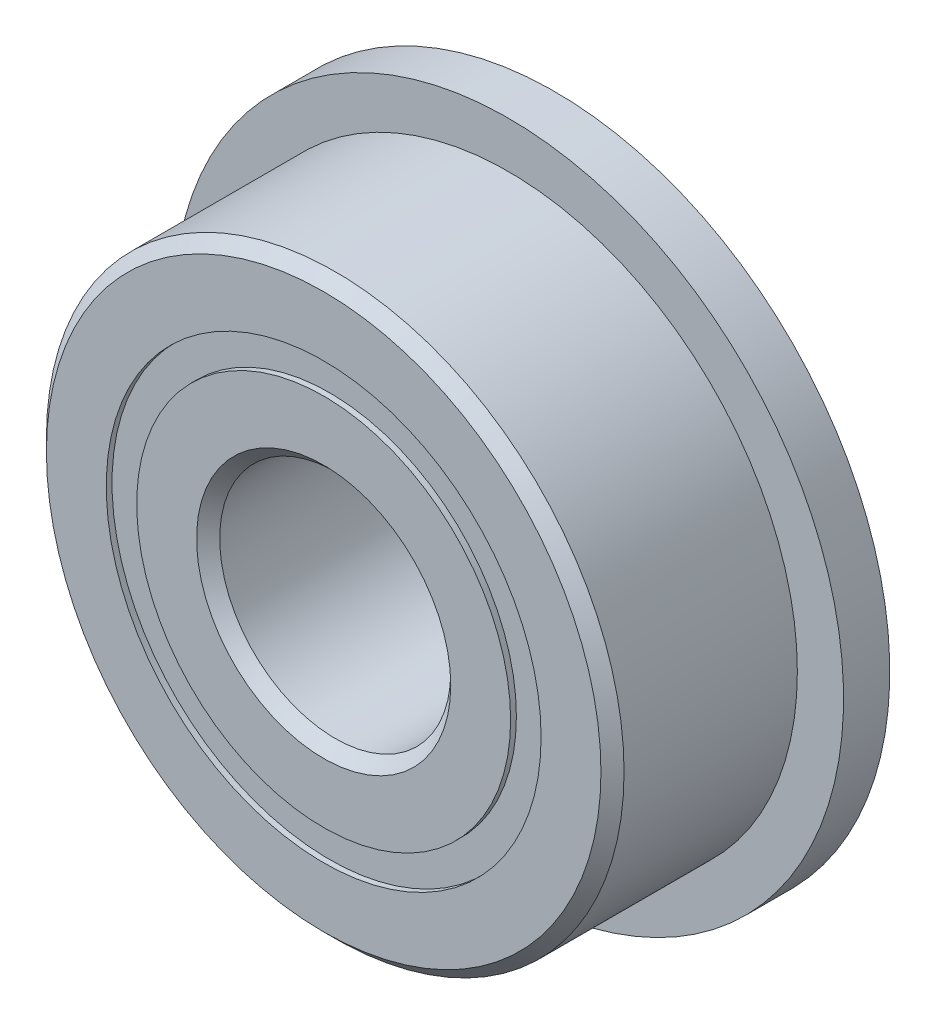
ISO-10303-21;
HEADER;
FILE_DESCRIPTION(('STEP AP214'),'2;1');
FILE_NAME('part.step','',(''),(''),'','','');
FILE_SCHEMA(('AUTOMOTIVE_DESIGN { 1 0 10303 214 1 1 1 1 }'));
ENDSEC;
DATA;
#1=APPLICATION_CONTEXT('core data for automotive mechanical design processes');
#2=APPLICATION_PROTOCOL_DEFINITION('international standard','automotive_design',2000,#1);
#3=PRODUCT_CONTEXT('',#1,'mechanical');
#4=PRODUCT('Part','Part','',(#3));
#5=PRODUCT_RELATED_PRODUCT_CATEGORY('part','',(#4));
#6=PRODUCT_DEFINITION_FORMATION('','',#4);
#7=PRODUCT_DEFINITION_CONTEXT('part definition',#1,'design');
#8=PRODUCT_DEFINITION('design','',#6,#7);
#9=PRODUCT_DEFINITION_SHAPE('','',#8);
#10=(LENGTH_UNIT() NAMED_UNIT(*) SI_UNIT(.MILLI.,.METRE.));
#11=(NAMED_UNIT(*) PLANE_ANGLE_UNIT() SI_UNIT($,.RADIAN.));
#12=(NAMED_UNIT(*) SI_UNIT($,.STERADIAN.) SOLID_ANGLE_UNIT());
#13=UNCERTAINTY_MEASURE_WITH_UNIT(LENGTH_MEASURE(1.E-05),#10,'distance_accuracy_value','');
#14=(GEOMETRIC_REPRESENTATION_CONTEXT(3) GLOBAL_UNCERTAINTY_ASSIGNED_CONTEXT((#13)) GLOBAL_UNIT_ASSIGNED_CONTEXT((#10,
#11,#12)) REPRESENTATION_CONTEXT('',''));
#15=CARTESIAN_POINT('',(0.,0.,0.));
#16=DIRECTION('',(0.,0.,1.));
#17=DIRECTION('',(1.,0.,0.));
#18=AXIS2_PLACEMENT_3D('',#15,#16,#17);
#19=CARTESIAN_POINT('',(0.,3.76373626373626,-1.9));
#20=DIRECTION('',(0.,0.,1.));
#21=DIRECTION('',(1.,0.,0.));
#22=AXIS2_PLACEMENT_3D('',#19,#20,#21);
#23=PLANE('',#22);
#24=CARTESIAN_POINT('',(0.,0.,-1.9));
#25=DIRECTION('',(0.,0.,1.));
#26=DIRECTION('',(1.,0.,0.));
#27=AXIS2_PLACEMENT_3D('',#24,#25,#26);
#28=CIRCLE('',#27,3.76373626373626);
#29=CARTESIAN_POINT('',(3.76373626373626,0.,-1.9));
#30=VERTEX_POINT('',#29);
#31=EDGE_CURVE('E56',#30,#30,#28,.T.);
#32=ORIENTED_EDGE('',*,*,#31,.F.);
#33=EDGE_LOOP('',(#32));
#34=FACE_BOUND('',#33,.T.);
#35=CARTESIAN_POINT('',(0.,0.,-1.9));
#36=DIRECTION('',(0.,0.,1.));
#37=DIRECTION('',(1.,0.,0.));
#38=AXIS2_PLACEMENT_3D('',#35,#36,#37);
#39=CIRCLE('',#38,3.23626373626373);
#40=CARTESIAN_POINT('',(3.23626373626373,0.,-1.9));
#41=VERTEX_POINT('',#40);
#42=EDGE_CURVE('E11',#41,#41,#39,.T.);
#43=ORIENTED_EDGE('',*,*,#42,.T.);
#44=EDGE_LOOP('',(#43));
#45=FACE_BOUND('',#44,.T.);
#46=ADVANCED_FACE('F42',(#34,#45),#23,.F.);
#47=CARTESIAN_POINT('',(0.,0.,2.));
#48=DIRECTION('',(0.,0.,1.));
#49=DIRECTION('',(1.,0.,0.));
#50=AXIS2_PLACEMENT_3D('',#47,#48,#49);
#51=CYLINDRICAL_SURFACE('',#50,3.23626373626374);
#52=ORIENTED_EDGE('',*,*,#42,.F.);
#53=EDGE_LOOP('',(#52));
#54=FACE_BOUND('',#53,.T.);
#55=CARTESIAN_POINT('',(0.,0.,-0.927189448602436));
#56=DIRECTION('',(0.,0.,1.));
#57=DIRECTION('',(1.,0.,0.));
#58=AXIS2_PLACEMENT_3D('',#55,#56,#57);
#59=CIRCLE('',#58,3.23626373626374);
#60=CARTESIAN_POINT('',(3.23626373626374,0.,-0.927189448602436));
#61=VERTEX_POINT('',#60);
#62=EDGE_CURVE('E48',#61,#61,#59,.T.);
#63=ORIENTED_EDGE('',*,*,#62,.T.);
#64=EDGE_LOOP('',(#63));
#65=FACE_BOUND('',#64,.T.);
#66=ADVANCED_FACE('F65',(#54,#65),#51,.F.);
#67=CARTESIAN_POINT('',(0.,3.76373626373626,-0.927189448602435));
#68=DIRECTION('',(0.,0.,-1.));
#69=DIRECTION('',(-1.,0.,0.));
#70=AXIS2_PLACEMENT_3D('',#67,#68,#69);
#71=PLANE('',#70);
#72=ORIENTED_EDGE('',*,*,#62,.F.);
#73=EDGE_LOOP('',(#72));
#74=FACE_BOUND('',#73,.T.);
#75=CARTESIAN_POINT('',(0.,0.,-0.927189448602436));
#76=DIRECTION('',(0.,0.,1.));
#77=DIRECTION('',(1.,0.,0.));
#78=AXIS2_PLACEMENT_3D('',#75,#76,#77);
#79=CIRCLE('',#78,3.76373626373626);
#80=CARTESIAN_POINT('',(3.76373626373626,0.,-0.927189448602436));
#81=VERTEX_POINT('',#80);
#82=EDGE_CURVE('E52',#81,#81,#79,.T.);
#83=ORIENTED_EDGE('',*,*,#82,.T.);
#84=EDGE_LOOP('',(#83));
#85=FACE_BOUND('',#84,.T.);
#86=ADVANCED_FACE('F69',(#74,#85),#71,.F.);
#87=CARTESIAN_POINT('',(0.,0.,2.));
#88=DIRECTION('',(0.,0.,1.));
#89=DIRECTION('',(1.,0.,0.));
#90=AXIS2_PLACEMENT_3D('',#87,#88,#89);
#91=CYLINDRICAL_SURFACE('',#90,3.76373626373626);
#92=ORIENTED_EDGE('',*,*,#82,.F.);
#93=EDGE_LOOP('',(#92));
#94=FACE_BOUND('',#93,.T.);
#95=ORIENTED_EDGE('',*,*,#31,.T.);
#96=EDGE_LOOP('',(#95));
#97=FACE_BOUND('',#96,.T.);
#98=ADVANCED_FACE('F62',(#94,#97),#91,.T.);
#99=CLOSED_SHELL('',(#46,#66,#86,#98));
#100=MANIFOLD_SOLID_BREP('B2',#99);
#101=CARTESIAN_POINT('',(0.,3.76373626373626,1.9));
#102=DIRECTION('',(0.,0.,-1.));
#103=DIRECTION('',(-1.,0.,0.));
#104=AXIS2_PLACEMENT_3D('',#101,#102,#103);
#105=PLANE('',#104);
#106=CARTESIAN_POINT('',(0.,0.,1.9));
#107=DIRECTION('',(0.,0.,1.));
#108=DIRECTION('',(1.,0.,0.));
#109=AXIS2_PLACEMENT_3D('',#106,#107,#108);
#110=CIRCLE('',#109,3.23626373626374);
#111=CARTESIAN_POINT('',(3.23626373626374,0.,1.9));
#112=VERTEX_POINT('',#111);
#113=EDGE_CURVE('E41',#112,#112,#110,.T.);
#114=ORIENTED_EDGE('',*,*,#113,.F.);
#115=EDGE_LOOP('',(#114));
#116=FACE_BOUND('',#115,.T.);
#117=CARTESIAN_POINT('',(0.,0.,1.9));
#118=DIRECTION('',(0.,0.,1.));
#119=DIRECTION('',(1.,0.,0.));
#120=AXIS2_PLACEMENT_3D('',#117,#118,#119);
#121=CIRCLE('',#120,3.76373626373626);
#122=CARTESIAN_POINT('',(3.76373626373626,0.,1.9));
#123=VERTEX_POINT('',#122);
#124=EDGE_CURVE('E124',#123,#123,#121,.T.);
#125=ORIENTED_EDGE('',*,*,#124,.T.);
#126=EDGE_LOOP('',(#125));
#127=FACE_BOUND('',#126,.T.);
#128=ADVANCED_FACE('F110',(#116,#127),#105,.F.);
#129=CARTESIAN_POINT('',(0.,0.,2.));
#130=DIRECTION('',(0.,0.,1.));
#131=DIRECTION('',(1.,0.,0.));
#132=AXIS2_PLACEMENT_3D('',#129,#130,#131);
#133=CYLINDRICAL_SURFACE('',#132,3.23626373626374);
#134=CARTESIAN_POINT('',(0.,0.,0.927189448602434));
#135=DIRECTION('',(0.,0.,1.));
#136=DIRECTION('',(1.,0.,0.));
#137=AXIS2_PLACEMENT_3D('',#134,#135,#136);
#138=CIRCLE('',#137,3.23626373626374);
#139=CARTESIAN_POINT('',(3.23626373626374,0.,0.927189448602434));
#140=VERTEX_POINT('',#139);
#141=EDGE_CURVE('E116',#140,#140,#138,.T.);
#142=ORIENTED_EDGE('',*,*,#141,.F.);
#143=EDGE_LOOP('',(#142));
#144=FACE_BOUND('',#143,.T.);
#145=ORIENTED_EDGE('',*,*,#113,.T.);
#146=EDGE_LOOP('',(#145));
#147=FACE_BOUND('',#146,.T.);
#148=ADVANCED_FACE('F139',(#144,#147),#133,.F.);
#149=CARTESIAN_POINT('',(0.,3.76373626373626,0.927189448602434));
#150=DIRECTION('',(0.,0.,1.));
#151=DIRECTION('',(1.,0.,0.));
#152=AXIS2_PLACEMENT_3D('',#149,#150,#151);
#153=PLANE('',#152);
#154=CARTESIAN_POINT('',(0.,0.,0.927189448602434));
#155=DIRECTION('',(0.,0.,1.));
#156=DIRECTION('',(1.,0.,0.));
#157=AXIS2_PLACEMENT_3D('',#154,#155,#156);
#158=CIRCLE('',#157,3.76373626373626);
#159=CARTESIAN_POINT('',(3.76373626373626,0.,0.927189448602434));
#160=VERTEX_POINT('',#159);
#161=EDGE_CURVE('E120',#160,#160,#158,.T.);
#162=ORIENTED_EDGE('',*,*,#161,.F.);
#163=EDGE_LOOP('',(#162));
#164=FACE_BOUND('',#163,.T.);
#165=ORIENTED_EDGE('',*,*,#141,.T.);
#166=EDGE_LOOP('',(#165));
#167=FACE_BOUND('',#166,.T.);
#168=ADVANCED_FACE('F134',(#164,#167),#153,.F.);
#169=CARTESIAN_POINT('',(0.,0.,2.));
#170=DIRECTION('',(0.,0.,1.));
#171=DIRECTION('',(1.,0.,0.));
#172=AXIS2_PLACEMENT_3D('',#169,#170,#171);
#173=CYLINDRICAL_SURFACE('',#172,3.76373626373626);
#174=ORIENTED_EDGE('',*,*,#124,.F.);
#175=EDGE_LOOP('',(#174));
#176=FACE_BOUND('',#175,.T.);
#177=ORIENTED_EDGE('',*,*,#161,.T.);
#178=EDGE_LOOP('',(#177));
#179=FACE_BOUND('',#178,.T.);
#180=ADVANCED_FACE('F131',(#176,#179),#173,.T.);
#181=CLOSED_SHELL('',(#128,#148,#168,#180));
#182=MANIFOLD_SOLID_BREP('B6',#181);
#183=CARTESIAN_POINT('',(-1.74999999999996,3.03108891324556,0.));
#184=DIRECTION('',(0.,0.,1.));
#185=DIRECTION('',(-0.499999999999989,0.866025403784445,0.));
#186=AXIS2_PLACEMENT_3D('',#183,#184,#185);
#187=SPHERICAL_SURFACE('',#186,0.927189448602435);
#188=CARTESIAN_POINT('',(-1.74999999999996,3.03108891324556,0.927189448602434));
#189=VERTEX_POINT('',#188);
#190=VERTEX_LOOP('',#189);
#191=FACE_BOUND('',#190,.T.);
#192=ADVANCED_FACE('F177',(#191),#187,.T.);
#193=CLOSED_SHELL('',(#192));
#194=MANIFOLD_SOLID_BREP('B36',#193);
#195=CARTESIAN_POINT('',(-3.03108891324552,1.75000000000004,0.));
#196=DIRECTION('',(0.,0.,1.));
#197=DIRECTION('',(-0.866025403784433,0.50000000000001,0.));
#198=AXIS2_PLACEMENT_3D('',#195,#196,#197);
#199=SPHERICAL_SURFACE('',#198,0.927189448602435);
#200=CARTESIAN_POINT('',(-3.03108891324552,1.75000000000004,0.927189448602434));
#201=VERTEX_POINT('',#200);
#202=VERTEX_LOOP('',#201);
#203=FACE_BOUND('',#202,.T.);
#204=ADVANCED_FACE('F197',(#203),#199,.T.);
#205=CLOSED_SHELL('',(#204));
#206=MANIFOLD_SOLID_BREP('B106',#205);
#207=CARTESIAN_POINT('',(-3.5,0.,0.));
#208=DIRECTION('',(0.,0.,1.));
#209=DIRECTION('',(-1.,0.,0.));
#210=AXIS2_PLACEMENT_3D('',#207,#208,#209);
#211=SPHERICAL_SURFACE('',#210,0.927189448602435);
#212=CARTESIAN_POINT('',(-3.5,0.,0.927189448602434));
#213=VERTEX_POINT('',#212);
#214=VERTEX_LOOP('',#213);
#215=FACE_BOUND('',#214,.T.);
#216=ADVANCED_FACE('F217',(#215),#211,.T.);
#217=CLOSED_SHELL('',(#216));
#218=MANIFOLD_SOLID_BREP('B173',#217);
#219=CARTESIAN_POINT('',(-3.03108891324555,-1.74999999999997,0.));
#220=DIRECTION('',(0.,0.,1.));
#221=DIRECTION('',(-0.866025403784443,-0.499999999999992,0.));
#222=AXIS2_PLACEMENT_3D('',#219,#220,#221);
#223=SPHERICAL_SURFACE('',#222,0.927189448602435);
#224=CARTESIAN_POINT('',(-3.03108891324555,-1.74999999999997,0.927189448602434));
#225=VERTEX_POINT('',#224);
#226=VERTEX_LOOP('',#225);
#227=FACE_BOUND('',#226,.T.);
#228=ADVANCED_FACE('F237',(#227),#223,.T.);
#229=CLOSED_SHELL('',(#228));
#230=MANIFOLD_SOLID_BREP('B193',#229);
#231=CARTESIAN_POINT('',(-1.75000000000003,-3.03108891324552,0.));
#232=DIRECTION('',(0.,0.,1.));
#233=DIRECTION('',(-0.500000000000007,-0.866025403784435,0.));
#234=AXIS2_PLACEMENT_3D('',#231,#232,#233);
#235=SPHERICAL_SURFACE('',#234,0.927189448602435);
#236=CARTESIAN_POINT('',(-1.75000000000003,-3.03108891324552,0.927189448602434));
#237=VERTEX_POINT('',#236);
#238=VERTEX_LOOP('',#237);
#239=FACE_BOUND('',#238,.T.);
#240=ADVANCED_FACE('F257',(#239),#235,.T.);
#241=CLOSED_SHELL('',(#240));
#242=MANIFOLD_SOLID_BREP('B213',#241);
#243=CARTESIAN_POINT('',(0.,-3.5,0.));
#244=DIRECTION('',(0.,0.,1.));
#245=DIRECTION('',(0.,-1.,0.));
#246=AXIS2_PLACEMENT_3D('',#243,#244,#245);
#247=SPHERICAL_SURFACE('',#246,0.927189448602435);
#248=CARTESIAN_POINT('',(0.,-3.5,0.927189448602434));
#249=VERTEX_POINT('',#248);
#250=VERTEX_LOOP('',#249);
#251=FACE_BOUND('',#250,.T.);
#252=ADVANCED_FACE('F277',(#251),#247,.T.);
#253=CLOSED_SHELL('',(#252));
#254=MANIFOLD_SOLID_BREP('B233',#253);
#255=CARTESIAN_POINT('',(1.74999999999998,-3.03108891324555,0.));
#256=DIRECTION('',(0.,0.,1.));
#257=DIRECTION('',(0.499999999999995,-0.866025403784442,0.));
#258=AXIS2_PLACEMENT_3D('',#255,#256,#257);
#259=SPHERICAL_SURFACE('',#258,0.927189448602435);
#260=CARTESIAN_POINT('',(1.74999999999998,-3.03108891324555,0.927189448602434));
#261=VERTEX_POINT('',#260);
#262=VERTEX_LOOP('',#261);
#263=FACE_BOUND('',#262,.T.);
#264=ADVANCED_FACE('F297',(#263),#259,.T.);
#265=CLOSED_SHELL('',(#264));
#266=MANIFOLD_SOLID_BREP('B253',#265);
#267=CARTESIAN_POINT('',(3.03108891324553,-1.75000000000001,0.));
#268=DIRECTION('',(0.,0.,1.));
#269=DIRECTION('',(0.866025403784436,-0.500000000000004,0.));
#270=AXIS2_PLACEMENT_3D('',#267,#268,#269);
#271=SPHERICAL_SURFACE('',#270,0.927189448602435);
#272=CARTESIAN_POINT('',(3.03108891324553,-1.75000000000001,0.927189448602434));
#273=VERTEX_POINT('',#272);
#274=VERTEX_LOOP('',#273);
#275=FACE_BOUND('',#274,.T.);
#276=ADVANCED_FACE('F317',(#275),#271,.T.);
#277=CLOSED_SHELL('',(#276));
#278=MANIFOLD_SOLID_BREP('B273',#277);
#279=CARTESIAN_POINT('',(3.5,0.,0.));
#280=DIRECTION('',(0.,0.,1.));
#281=DIRECTION('',(1.,0.,0.));
#282=AXIS2_PLACEMENT_3D('',#279,#280,#281);
#283=SPHERICAL_SURFACE('',#282,0.927189448602435);
#284=CARTESIAN_POINT('',(3.5,0.,0.927189448602434));
#285=VERTEX_POINT('',#284);
#286=VERTEX_LOOP('',#285);
#287=FACE_BOUND('',#286,.T.);
#288=ADVANCED_FACE('F337',(#287),#283,.T.);
#289=CLOSED_SHELL('',(#288));
#290=MANIFOLD_SOLID_BREP('B293',#289);
#291=CARTESIAN_POINT('',(3.03108891324554,1.74999999999999,0.));
#292=DIRECTION('',(0.,0.,1.));
#293=DIRECTION('',(0.86602540378444,0.499999999999998,0.));
#294=AXIS2_PLACEMENT_3D('',#291,#292,#293);
#295=SPHERICAL_SURFACE('',#294,0.927189448602435);
#296=CARTESIAN_POINT('',(3.03108891324554,1.74999999999999,0.927189448602434));
#297=VERTEX_POINT('',#296);
#298=VERTEX_LOOP('',#297);
#299=FACE_BOUND('',#298,.T.);
#300=ADVANCED_FACE('F357',(#299),#295,.T.);
#301=CLOSED_SHELL('',(#300));
#302=MANIFOLD_SOLID_BREP('B313',#301);
#303=CARTESIAN_POINT('',(1.75,3.03108891324553,0.));
#304=DIRECTION('',(0.,0.,1.));
#305=DIRECTION('',(0.500000000000001,0.866025403784438,0.));
#306=AXIS2_PLACEMENT_3D('',#303,#304,#305);
#307=SPHERICAL_SURFACE('',#306,0.927189448602435);
#308=CARTESIAN_POINT('',(1.75,3.03108891324553,0.927189448602434));
#309=VERTEX_POINT('',#308);
#310=VERTEX_LOOP('',#309);
#311=FACE_BOUND('',#310,.T.);
#312=ADVANCED_FACE('F377',(#311),#307,.T.);
#313=CLOSED_SHELL('',(#312));
#314=MANIFOLD_SOLID_BREP('B333',#313);
#315=CARTESIAN_POINT('',(0.,3.5,0.));
#316=DIRECTION('',(0.,0.,1.));
#317=DIRECTION('',(0.,1.,0.));
#318=AXIS2_PLACEMENT_3D('',#315,#316,#317);
#319=SPHERICAL_SURFACE('',#318,0.927189448602435);
#320=CARTESIAN_POINT('',(0.,3.5,0.927189448602434));
#321=VERTEX_POINT('',#320);
#322=VERTEX_LOOP('',#321);
#323=FACE_BOUND('',#322,.T.);
#324=ADVANCED_FACE('F400',(#323),#319,.T.);
#325=CLOSED_SHELL('',(#324));
#326=MANIFOLD_SOLID_BREP('B353',#325);
#327=CARTESIAN_POINT('',(0.,3.23626373626374,2.));
#328=DIRECTION('',(0.,0.,-1.));
#329=DIRECTION('',(-1.,0.,0.));
#330=AXIS2_PLACEMENT_3D('',#327,#328,#329);
#331=PLANE('',#330);
#332=CARTESIAN_POINT('',(0.,0.,2.));
#333=DIRECTION('',(0.,0.,1.));
#334=DIRECTION('',(1.,0.,0.));
#335=AXIS2_PLACEMENT_3D('',#332,#333,#334);
#336=CIRCLE('',#335,2.2);
#337=CARTESIAN_POINT('',(2.2,0.,2.));
#338=VERTEX_POINT('',#337);
#339=EDGE_CURVE('E448',#338,#338,#336,.T.);
#340=ORIENTED_EDGE('',*,*,#339,.F.);
#341=EDGE_LOOP('',(#340));
#342=FACE_BOUND('',#341,.T.);
#343=CARTESIAN_POINT('',(0.,0.,2.));
#344=DIRECTION('',(0.,0.,1.));
#345=DIRECTION('',(1.,0.,0.));
#346=AXIS2_PLACEMENT_3D('',#343,#344,#345);
#347=CIRCLE('',#346,3.23626373626374);
#348=CARTESIAN_POINT('',(3.23626373626374,0.,2.));
#349=VERTEX_POINT('',#348);
#350=EDGE_CURVE('E399',#349,#349,#347,.T.);
#351=ORIENTED_EDGE('',*,*,#350,.T.);
#352=EDGE_LOOP('',(#351));
#353=FACE_BOUND('',#352,.T.);
#354=ADVANCED_FACE('F420',(#342,#353),#331,.F.);
#355=CARTESIAN_POINT('',(0.,0.,2.));
#356=DIRECTION('',(0.,0.,1.));
#357=DIRECTION('',(1.,0.,0.));
#358=AXIS2_PLACEMENT_3D('',#355,#356,#357);
#359=CYLINDRICAL_SURFACE('',#358,3.23626373626374);
#360=ORIENTED_EDGE('',*,*,#350,.F.);
#361=EDGE_LOOP('',(#360));
#362=FACE_BOUND('',#361,.T.);
#363=CARTESIAN_POINT('',(0.,0.,0.888888888888888));
#364=DIRECTION('',(0.,0.,1.));
#365=DIRECTION('',(1.,0.,0.));
#366=AXIS2_PLACEMENT_3D('',#363,#364,#365);
#367=CIRCLE('',#366,3.23626373626374);
#368=CARTESIAN_POINT('',(3.23626373626374,0.,0.888888888888888));
#369=VERTEX_POINT('',#368);
#370=EDGE_CURVE('E426',#369,#369,#367,.T.);
#371=ORIENTED_EDGE('',*,*,#370,.T.);
#372=EDGE_LOOP('',(#371));
#373=FACE_BOUND('',#372,.T.);
#374=ADVANCED_FACE('F455',(#362,#373),#359,.T.);
#375=CARTESIAN_POINT('',(0.,0.,0.));
#376=DIRECTION('',(0.,0.,1.));
#377=DIRECTION('',(1.,0.,0.));
#378=AXIS2_PLACEMENT_3D('',#375,#376,#377);
#379=TOROIDAL_SURFACE('',#378,3.49999999999999,0.927189448602433);
#380=ORIENTED_EDGE('',*,*,#370,.F.);
#381=EDGE_LOOP('',(#380));
#382=FACE_BOUND('',#381,.T.);
#383=CARTESIAN_POINT('',(0.,0.,-0.88888888888889));
#384=DIRECTION('',(0.,0.,1.));
#385=DIRECTION('',(1.,0.,0.));
#386=AXIS2_PLACEMENT_3D('',#383,#384,#385);
#387=CIRCLE('',#386,3.23626373626373);
#388=CARTESIAN_POINT('',(3.23626373626373,0.,-0.88888888888889));
#389=VERTEX_POINT('',#388);
#390=EDGE_CURVE('E430',#389,#389,#387,.T.);
#391=ORIENTED_EDGE('',*,*,#390,.T.);
#392=EDGE_LOOP('',(#391));
#393=FACE_BOUND('',#392,.T.);
#394=ADVANCED_FACE('F459',(#382,#393),#379,.F.);
#395=CARTESIAN_POINT('',(0.,0.,2.));
#396=DIRECTION('',(0.,0.,1.));
#397=DIRECTION('',(1.,0.,0.));
#398=AXIS2_PLACEMENT_3D('',#395,#396,#397);
#399=CYLINDRICAL_SURFACE('',#398,3.23626373626374);
#400=ORIENTED_EDGE('',*,*,#390,.F.);
#401=EDGE_LOOP('',(#400));
#402=FACE_BOUND('',#401,.T.);
#403=CARTESIAN_POINT('',(0.,0.,-2.));
#404=DIRECTION('',(0.,0.,1.));
#405=DIRECTION('',(1.,0.,0.));
#406=AXIS2_PLACEMENT_3D('',#403,#404,#405);
#407=CIRCLE('',#406,3.23626373626374);
#408=CARTESIAN_POINT('',(3.23626373626374,0.,-2.));
#409=VERTEX_POINT('',#408);
#410=EDGE_CURVE('E434',#409,#409,#407,.T.);
#411=ORIENTED_EDGE('',*,*,#410,.T.);
#412=EDGE_LOOP('',(#411));
#413=FACE_BOUND('',#412,.T.);
#414=ADVANCED_FACE('F464',(#402,#413),#399,.T.);
#415=CARTESIAN_POINT('',(0.,2.2,-2.));
#416=DIRECTION('',(0.,0.,1.));
#417=DIRECTION('',(1.,0.,0.));
#418=AXIS2_PLACEMENT_3D('',#415,#416,#417);
#419=PLANE('',#418);
#420=ORIENTED_EDGE('',*,*,#410,.F.);
#421=EDGE_LOOP('',(#420));
#422=FACE_BOUND('',#421,.T.);
#423=CARTESIAN_POINT('',(0.,0.,-2.));
#424=DIRECTION('',(0.,0.,1.));
#425=DIRECTION('',(1.,0.,0.));
#426=AXIS2_PLACEMENT_3D('',#423,#424,#425);
#427=CIRCLE('',#426,2.2);
#428=CARTESIAN_POINT('',(2.2,0.,-2.));
#429=VERTEX_POINT('',#428);
#430=EDGE_CURVE('E439',#429,#429,#427,.T.);
#431=ORIENTED_EDGE('',*,*,#430,.T.);
#432=EDGE_LOOP('',(#431));
#433=FACE_BOUND('',#432,.T.);
#434=ADVANCED_FACE('F470',(#422,#433),#419,.F.);
#435=CARTESIAN_POINT('',(0.,0.,-1.8));
#436=DIRECTION('',(0.,0.,-1.));
#437=DIRECTION('',(-1.,0.,0.));
#438=AXIS2_PLACEMENT_3D('',#435,#436,#437);
#439=CONICAL_SURFACE('',#438,2.,0.785398163397448);
#440=ORIENTED_EDGE('',*,*,#430,.F.);
#441=EDGE_LOOP('',(#440));
#442=FACE_BOUND('',#441,.T.);
#443=CARTESIAN_POINT('',(0.,0.,-1.8));
#444=DIRECTION('',(0.,0.,1.));
#445=DIRECTION('',(1.,0.,0.));
#446=AXIS2_PLACEMENT_3D('',#443,#444,#445);
#447=CIRCLE('',#446,2.);
#448=CARTESIAN_POINT('',(2.,0.,-1.8));
#449=VERTEX_POINT('',#448);
#450=EDGE_CURVE('E442',#449,#449,#447,.T.);
#451=ORIENTED_EDGE('',*,*,#450,.T.);
#452=EDGE_LOOP('',(#451));
#453=FACE_BOUND('',#452,.T.);
#454=ADVANCED_FACE('F474',(#442,#453),#439,.F.);
#455=CARTESIAN_POINT('',(0.,0.,2.));
#456=DIRECTION('',(0.,0.,1.));
#457=DIRECTION('',(1.,0.,0.));
#458=AXIS2_PLACEMENT_3D('',#455,#456,#457);
#459=CYLINDRICAL_SURFACE('',#458,2.);
#460=ORIENTED_EDGE('',*,*,#450,.F.);
#461=EDGE_LOOP('',(#460));
#462=FACE_BOUND('',#461,.T.);
#463=CARTESIAN_POINT('',(0.,0.,1.8));
#464=DIRECTION('',(0.,0.,1.));
#465=DIRECTION('',(1.,0.,0.));
#466=AXIS2_PLACEMENT_3D('',#463,#464,#465);
#467=CIRCLE('',#466,2.);
#468=CARTESIAN_POINT('',(2.,0.,1.8));
#469=VERTEX_POINT('',#468);
#470=EDGE_CURVE('E445',#469,#469,#467,.T.);
#471=ORIENTED_EDGE('',*,*,#470,.T.);
#472=EDGE_LOOP('',(#471));
#473=FACE_BOUND('',#472,.T.);
#474=ADVANCED_FACE('F478',(#462,#473),#459,.F.);
#475=CARTESIAN_POINT('',(0.,0.,2.));
#476=DIRECTION('',(0.,0.,1.));
#477=DIRECTION('',(1.,0.,0.));
#478=AXIS2_PLACEMENT_3D('',#475,#476,#477);
#479=CONICAL_SURFACE('',#478,2.2,0.785398163397449);
#480=ORIENTED_EDGE('',*,*,#470,.F.);
#481=EDGE_LOOP('',(#480));
#482=FACE_BOUND('',#481,.T.);
#483=ORIENTED_EDGE('',*,*,#339,.T.);
#484=EDGE_LOOP('',(#483));
#485=FACE_BOUND('',#484,.T.);
#486=ADVANCED_FACE('F452',(#482,#485),#479,.F.);
#487=CLOSED_SHELL('',(#354,#374,#394,#414,#434,#454,#474,#486));
#488=MANIFOLD_SOLID_BREP('B373',#487);
#489=CARTESIAN_POINT('',(0.,0.,1.8));
#490=DIRECTION('',(0.,0.,-1.));
#491=DIRECTION('',(-1.,0.,0.));
#492=AXIS2_PLACEMENT_3D('',#489,#490,#491);
#493=CONICAL_SURFACE('',#492,5.,0.785398163397449);
#494=CARTESIAN_POINT('',(0.,0.,2.));
#495=DIRECTION('',(0.,0.,1.));
#496=DIRECTION('',(1.,0.,0.));
#497=AXIS2_PLACEMENT_3D('',#494,#495,#496);
#498=CIRCLE('',#497,4.8);
#499=CARTESIAN_POINT('',(4.8,0.,2.));
#500=VERTEX_POINT('',#499);
#501=EDGE_CURVE('E564',#500,#500,#498,.T.);
#502=ORIENTED_EDGE('',*,*,#501,.F.);
#503=EDGE_LOOP('',(#502));
#504=FACE_BOUND('',#503,.T.);
#505=CARTESIAN_POINT('',(0.,0.,1.8));
#506=DIRECTION('',(0.,0.,1.));
#507=DIRECTION('',(1.,0.,0.));
#508=AXIS2_PLACEMENT_3D('',#505,#506,#507);
#509=CIRCLE('',#508,5.);
#510=CARTESIAN_POINT('',(5.,0.,1.8));
#511=VERTEX_POINT('',#510);
#512=EDGE_CURVE('E419',#511,#511,#509,.T.);
#513=ORIENTED_EDGE('',*,*,#512,.T.);
#514=EDGE_LOOP('',(#513));
#515=FACE_BOUND('',#514,.T.);
#516=ADVANCED_FACE('F542',(#504,#515),#493,.T.);
#517=CARTESIAN_POINT('',(0.,0.,2.));
#518=DIRECTION('',(0.,0.,1.));
#519=DIRECTION('',(1.,0.,0.));
#520=AXIS2_PLACEMENT_3D('',#517,#518,#519);
#521=CYLINDRICAL_SURFACE('',#520,5.);
#522=CARTESIAN_POINT('',(0.,0.,-1.2));
#523=DIRECTION('',(0.,0.,1.));
#524=DIRECTION('',(1.,0.,0.));
#525=AXIS2_PLACEMENT_3D('',#522,#523,#524);
#526=CIRCLE('',#525,5.);
#527=CARTESIAN_POINT('',(5.,0.,-1.2));
#528=VERTEX_POINT('',#527);
#529=EDGE_CURVE('E567',#528,#528,#526,.T.);
#530=ORIENTED_EDGE('',*,*,#529,.T.);
#531=EDGE_LOOP('',(#530));
#532=FACE_BOUND('',#531,.T.);
#533=ORIENTED_EDGE('',*,*,#512,.F.);
#534=EDGE_LOOP('',(#533));
#535=FACE_BOUND('',#534,.T.);
#536=ADVANCED_FACE('F587',(#532,#535),#521,.T.);
#537=CARTESIAN_POINT('',(0.,4.8,-2.));
#538=DIRECTION('',(0.,0.,1.));
#539=DIRECTION('',(1.,0.,0.));
#540=AXIS2_PLACEMENT_3D('',#537,#538,#539);
#541=PLANE('',#540);
#542=CARTESIAN_POINT('',(0.,0.,-2.));
#543=DIRECTION('',(0.,0.,1.));
#544=DIRECTION('',(1.,0.,0.));
#545=AXIS2_PLACEMENT_3D('',#542,#543,#544);
#546=CIRCLE('',#545,3.76373626373626);
#547=CARTESIAN_POINT('',(3.76373626373626,0.,-2.));
#548=VERTEX_POINT('',#547);
#549=EDGE_CURVE('E548',#548,#548,#546,.T.);
#550=ORIENTED_EDGE('',*,*,#549,.T.);
#551=EDGE_LOOP('',(#550));
#552=FACE_BOUND('',#551,.T.);
#553=CARTESIAN_POINT('',(0.,0.,-2.));
#554=DIRECTION('',(0.,0.,-1.));
#555=DIRECTION('',(-1.,0.,0.));
#556=AXIS2_PLACEMENT_3D('',#553,#554,#555);
#557=CIRCLE('',#556,5.8);
#558=CARTESIAN_POINT('',(-5.8,0.,-2.));
#559=VERTEX_POINT('',#558);
#560=EDGE_CURVE('E570',#559,#559,#557,.T.);
#561=ORIENTED_EDGE('',*,*,#560,.T.);
#562=EDGE_LOOP('',(#561));
#563=FACE_BOUND('',#562,.T.);
#564=ADVANCED_FACE('F590',(#552,#563),#541,.F.);
#565=CARTESIAN_POINT('',(0.,0.,2.));
#566=DIRECTION('',(0.,0.,1.));
#567=DIRECTION('',(1.,0.,0.));
#568=AXIS2_PLACEMENT_3D('',#565,#566,#567);
#569=CYLINDRICAL_SURFACE('',#568,3.76373626373626);
#570=CARTESIAN_POINT('',(0.,0.,-0.88888888888889));
#571=DIRECTION('',(0.,0.,1.));
#572=DIRECTION('',(1.,0.,0.));
#573=AXIS2_PLACEMENT_3D('',#570,#571,#572);
#574=CIRCLE('',#573,3.76373626373626);
#575=CARTESIAN_POINT('',(3.76373626373626,0.,-0.88888888888889));
#576=VERTEX_POINT('',#575);
#577=EDGE_CURVE('E552',#576,#576,#574,.T.);
#578=ORIENTED_EDGE('',*,*,#577,.T.);
#579=EDGE_LOOP('',(#578));
#580=FACE_BOUND('',#579,.T.);
#581=ORIENTED_EDGE('',*,*,#549,.F.);
#582=EDGE_LOOP('',(#581));
#583=FACE_BOUND('',#582,.T.);
#584=ADVANCED_FACE('F595',(#580,#583),#569,.F.);
#585=CARTESIAN_POINT('',(0.,0.,0.));
#586=DIRECTION('',(0.,0.,1.));
#587=DIRECTION('',(1.,0.,0.));
#588=AXIS2_PLACEMENT_3D('',#585,#586,#587);
#589=TOROIDAL_SURFACE('',#588,3.5,0.927189448602435);
#590=ORIENTED_EDGE('',*,*,#577,.F.);
#591=EDGE_LOOP('',(#590));
#592=FACE_BOUND('',#591,.T.);
#593=CARTESIAN_POINT('',(0.,0.,0.888888888888888));
#594=DIRECTION('',(0.,0.,1.));
#595=DIRECTION('',(1.,0.,0.));
#596=AXIS2_PLACEMENT_3D('',#593,#594,#595);
#597=CIRCLE('',#596,3.76373626373626);
#598=CARTESIAN_POINT('',(3.76373626373626,0.,0.888888888888888));
#599=VERTEX_POINT('',#598);
#600=EDGE_CURVE('E556',#599,#599,#597,.T.);
#601=ORIENTED_EDGE('',*,*,#600,.T.);
#602=EDGE_LOOP('',(#601));
#603=FACE_BOUND('',#602,.T.);
#604=ADVANCED_FACE('F601',(#592,#603),#589,.F.);
#605=CARTESIAN_POINT('',(0.,0.,2.));
#606=DIRECTION('',(0.,0.,1.));
#607=DIRECTION('',(1.,0.,0.));
#608=AXIS2_PLACEMENT_3D('',#605,#606,#607);
#609=CYLINDRICAL_SURFACE('',#608,3.76373626373626);
#610=ORIENTED_EDGE('',*,*,#600,.F.);
#611=EDGE_LOOP('',(#610));
#612=FACE_BOUND('',#611,.T.);
#613=CARTESIAN_POINT('',(0.,0.,2.));
#614=DIRECTION('',(0.,0.,1.));
#615=DIRECTION('',(1.,0.,0.));
#616=AXIS2_PLACEMENT_3D('',#613,#614,#615);
#617=CIRCLE('',#616,3.76373626373626);
#618=CARTESIAN_POINT('',(3.76373626373626,0.,2.));
#619=VERTEX_POINT('',#618);
#620=EDGE_CURVE('E561',#619,#619,#617,.T.);
#621=ORIENTED_EDGE('',*,*,#620,.T.);
#622=EDGE_LOOP('',(#621));
#623=FACE_BOUND('',#622,.T.);
#624=ADVANCED_FACE('F605',(#612,#623),#609,.F.);
#625=CARTESIAN_POINT('',(0.,4.8,2.));
#626=DIRECTION('',(0.,0.,-1.));
#627=DIRECTION('',(-1.,0.,0.));
#628=AXIS2_PLACEMENT_3D('',#625,#626,#627);
#629=PLANE('',#628);
#630=ORIENTED_EDGE('',*,*,#620,.F.);
#631=EDGE_LOOP('',(#630));
#632=FACE_BOUND('',#631,.T.);
#633=ORIENTED_EDGE('',*,*,#501,.T.);
#634=EDGE_LOOP('',(#633));
#635=FACE_BOUND('',#634,.T.);
#636=ADVANCED_FACE('F583',(#632,#635),#629,.F.);
#637=CARTESIAN_POINT('',(0.,3.76373626373626,-1.2));
#638=DIRECTION('',(0.,0.,1.));
#639=DIRECTION('',(1.,0.,0.));
#640=AXIS2_PLACEMENT_3D('',#637,#638,#639);
#641=PLANE('',#640);
#642=CARTESIAN_POINT('',(0.,0.,-1.2));
#643=DIRECTION('',(0.,0.,-1.));
#644=DIRECTION('',(-1.,0.,0.));
#645=AXIS2_PLACEMENT_3D('',#642,#643,#644);
#646=CIRCLE('',#645,5.8);
#647=CARTESIAN_POINT('',(-5.8,0.,-1.2));
#648=VERTEX_POINT('',#647);
#649=EDGE_CURVE('E573',#648,#648,#646,.T.);
#650=ORIENTED_EDGE('',*,*,#649,.F.);
#651=EDGE_LOOP('',(#650));
#652=FACE_BOUND('',#651,.T.);
#653=ORIENTED_EDGE('',*,*,#529,.F.);
#654=EDGE_LOOP('',(#653));
#655=FACE_BOUND('',#654,.T.);
#656=ADVANCED_FACE('F580',(#652,#655),#641,.T.);
#657=CARTESIAN_POINT('',(0.,0.,-2.));
#658=DIRECTION('',(0.,0.,-1.));
#659=DIRECTION('',(-1.,0.,0.));
#660=AXIS2_PLACEMENT_3D('',#657,#658,#659);
#661=CYLINDRICAL_SURFACE('',#660,5.8);
#662=ORIENTED_EDGE('',*,*,#649,.T.);
#663=EDGE_LOOP('',(#662));
#664=FACE_BOUND('',#663,.T.);
#665=ORIENTED_EDGE('',*,*,#560,.F.);
#666=EDGE_LOOP('',(#665));
#667=FACE_BOUND('',#666,.T.);
#668=ADVANCED_FACE('F577',(#664,#667),#661,.T.);
#669=CLOSED_SHELL('',(#516,#536,#564,#584,#604,#624,#636,#656,#668));
#670=MANIFOLD_SOLID_BREP('B394',#669);
#671=ADVANCED_BREP_SHAPE_REPRESENTATION('',(#18,#100,#182,#194,#206,#218,#230,#242,#254,#266,
#278,#290,#302,#314,#326,#488,#670),#14);
#672=SHAPE_DEFINITION_REPRESENTATION(#9,#671);
ENDSEC;
END-ISO-10303-21;
